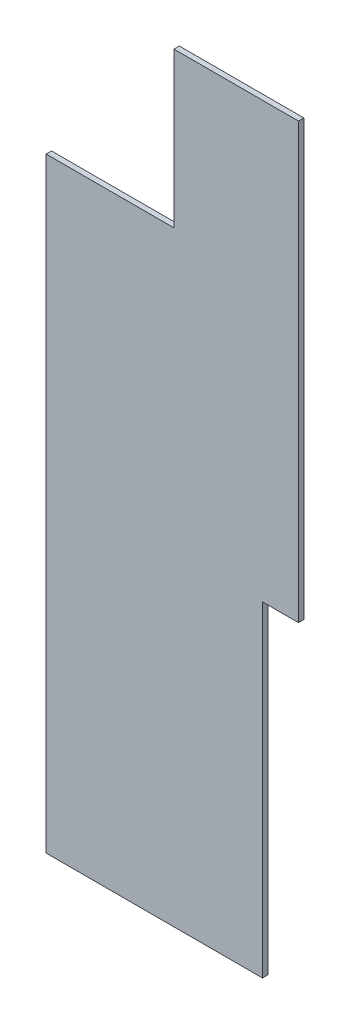
ISO-10303-21;
HEADER;
FILE_DESCRIPTION(('STEP AP214'),'2;1');
FILE_NAME('part.step','',(''),(''),'','','');
FILE_SCHEMA(('AUTOMOTIVE_DESIGN { 1 0 10303 214 1 1 1 1 }'));
ENDSEC;
DATA;
#1=APPLICATION_CONTEXT('core data for automotive mechanical design processes');
#2=APPLICATION_PROTOCOL_DEFINITION('international standard','automotive_design',2000,#1);
#3=PRODUCT_CONTEXT('',#1,'mechanical');
#4=PRODUCT('Part','Part','',(#3));
#5=PRODUCT_RELATED_PRODUCT_CATEGORY('part','',(#4));
#6=PRODUCT_DEFINITION_FORMATION('','',#4);
#7=PRODUCT_DEFINITION_CONTEXT('part definition',#1,'design');
#8=PRODUCT_DEFINITION('design','',#6,#7);
#9=PRODUCT_DEFINITION_SHAPE('','',#8);
#10=(LENGTH_UNIT() NAMED_UNIT(*) SI_UNIT(.MILLI.,.METRE.));
#11=(NAMED_UNIT(*) PLANE_ANGLE_UNIT() SI_UNIT($,.RADIAN.));
#12=(NAMED_UNIT(*) SI_UNIT($,.STERADIAN.) SOLID_ANGLE_UNIT());
#13=UNCERTAINTY_MEASURE_WITH_UNIT(LENGTH_MEASURE(1.E-05),#10,'distance_accuracy_value','');
#14=(GEOMETRIC_REPRESENTATION_CONTEXT(3) GLOBAL_UNCERTAINTY_ASSIGNED_CONTEXT((#13)) GLOBAL_UNIT_ASSIGNED_CONTEXT((#10,
#11,#12)) REPRESENTATION_CONTEXT('',''));
#15=CARTESIAN_POINT('',(0.,0.,0.));
#16=DIRECTION('',(0.,0.,1.));
#17=DIRECTION('',(1.,0.,0.));
#18=AXIS2_PLACEMENT_3D('',#15,#16,#17);
#19=CARTESIAN_POINT('',(1520.,0.,-15.));
#20=DIRECTION('',(0.,-1.,0.));
#21=DIRECTION('',(1.,0.,0.));
#22=AXIS2_PLACEMENT_3D('',#19,#20,#21);
#23=PLANE('',#22);
#24=DIRECTION('',(1.,0.,0.));
#25=VECTOR('',#24,1.);
#26=CARTESIAN_POINT('',(1520.,0.,-15.));
#27=LINE('',#26,#25);
#28=CARTESIAN_POINT('',(0.,0.,-15.));
#29=VERTEX_POINT('',#28);
#30=CARTESIAN_POINT('',(601.,0.,-15.));
#31=VERTEX_POINT('',#30);
#32=EDGE_CURVE('E120',#29,#31,#27,.T.);
#33=ORIENTED_EDGE('',*,*,#32,.T.);
#34=DIRECTION('',(0.,0.,1.));
#35=VECTOR('',#34,1.);
#36=CARTESIAN_POINT('',(601.,0.,-15.));
#37=LINE('',#36,#35);
#38=CARTESIAN_POINT('',(601.,0.,0.));
#39=VERTEX_POINT('',#38);
#40=EDGE_CURVE('E102',#31,#39,#37,.T.);
#41=ORIENTED_EDGE('',*,*,#40,.T.);
#42=DIRECTION('',(1.,0.,0.));
#43=VECTOR('',#42,1.);
#44=CARTESIAN_POINT('',(1520.,0.,0.));
#45=LINE('',#44,#43);
#46=CARTESIAN_POINT('',(0.,0.,0.));
#47=VERTEX_POINT('',#46);
#48=EDGE_CURVE('E127',#47,#39,#45,.T.);
#49=ORIENTED_EDGE('',*,*,#48,.F.);
#50=DIRECTION('',(0.,0.,1.));
#51=VECTOR('',#50,1.);
#52=CARTESIAN_POINT('',(0.,0.,-15.));
#53=LINE('',#52,#51);
#54=EDGE_CURVE('E123',#29,#47,#53,.T.);
#55=ORIENTED_EDGE('',*,*,#54,.F.);
#56=EDGE_LOOP('',(#33,#41,#49,#55));
#57=FACE_BOUND('',#56,.T.);
#58=ADVANCED_FACE('F38',(#57),#23,.T.);
#59=CARTESIAN_POINT('',(0.,0.,-15.));
#60=DIRECTION('',(0.,0.,-1.));
#61=DIRECTION('',(-1.,0.,0.));
#62=AXIS2_PLACEMENT_3D('',#59,#60,#61);
#63=PLANE('',#62);
#64=DIRECTION('',(-1.,0.,0.));
#65=VECTOR('',#64,1.);
#66=CARTESIAN_POINT('',(-1.24043436701946E-13,905.,-15.));
#67=LINE('',#66,#65);
#68=CARTESIAN_POINT('',(701.,905.,-15.));
#69=VERTEX_POINT('',#68);
#70=CARTESIAN_POINT('',(601.,905.,-15.));
#71=VERTEX_POINT('',#70);
#72=EDGE_CURVE('E114',#69,#71,#67,.T.);
#73=ORIENTED_EDGE('',*,*,#72,.T.);
#74=DIRECTION('',(0.,1.,0.));
#75=VECTOR('',#74,1.);
#76=CARTESIAN_POINT('',(601.,0.,-15.));
#77=LINE('',#76,#75);
#78=EDGE_CURVE('E106',#31,#71,#77,.T.);
#79=ORIENTED_EDGE('',*,*,#78,.F.);
#80=ORIENTED_EDGE('',*,*,#32,.F.);
#81=DIRECTION('',(0.,-1.,0.));
#82=VECTOR('',#81,1.);
#83=CARTESIAN_POINT('',(0.,0.,-15.));
#84=LINE('',#83,#82);
#85=CARTESIAN_POINT('',(0.,1682.,-15.));
#86=VERTEX_POINT('',#85);
#87=EDGE_CURVE('E61',#86,#29,#84,.T.);
#88=ORIENTED_EDGE('',*,*,#87,.F.);
#89=DIRECTION('',(1.,0.,0.));
#90=VECTOR('',#89,1.);
#91=CARTESIAN_POINT('',(0.,1682.,-15.));
#92=LINE('',#91,#90);
#93=CARTESIAN_POINT('',(355.,1682.,-15.));
#94=VERTEX_POINT('',#93);
#95=EDGE_CURVE('E158',#86,#94,#92,.T.);
#96=ORIENTED_EDGE('',*,*,#95,.T.);
#97=DIRECTION('',(0.,-1.,0.));
#98=VECTOR('',#97,1.);
#99=CARTESIAN_POINT('',(354.999999999998,-4.12460763218297E-13,-15.));
#100=LINE('',#99,#98);
#101=CARTESIAN_POINT('',(355.,2112.,-15.));
#102=VERTEX_POINT('',#101);
#103=EDGE_CURVE('E161',#102,#94,#100,.T.);
#104=ORIENTED_EDGE('',*,*,#103,.F.);
#105=DIRECTION('',(1.,0.,0.));
#106=VECTOR('',#105,1.);
#107=CARTESIAN_POINT('',(0.,2112.,-15.));
#108=LINE('',#107,#106);
#109=CARTESIAN_POINT('',(701.,2112.,-15.));
#110=VERTEX_POINT('',#109);
#111=EDGE_CURVE('E163',#102,#110,#108,.T.);
#112=ORIENTED_EDGE('',*,*,#111,.T.);
#113=DIRECTION('',(0.,-1.,0.));
#114=VECTOR('',#113,1.);
#115=CARTESIAN_POINT('',(701.,2112.,-15.));
#116=LINE('',#115,#114);
#117=EDGE_CURVE('E52',#110,#69,#116,.T.);
#118=ORIENTED_EDGE('',*,*,#117,.T.);
#119=EDGE_LOOP('',(#73,#79,#80,#88,#96,#104,#112,#118));
#120=FACE_BOUND('',#119,.T.);
#121=ADVANCED_FACE('F119',(#120),#63,.T.);
#122=CARTESIAN_POINT('',(0.,0.,0.));
#123=DIRECTION('',(0.,0.,-1.));
#124=DIRECTION('',(-1.,0.,0.));
#125=AXIS2_PLACEMENT_3D('',#122,#123,#124);
#126=PLANE('',#125);
#127=DIRECTION('',(0.,-1.,0.));
#128=VECTOR('',#127,1.);
#129=CARTESIAN_POINT('',(601.,0.,0.));
#130=LINE('',#129,#128);
#131=CARTESIAN_POINT('',(601.,905.,0.));
#132=VERTEX_POINT('',#131);
#133=EDGE_CURVE('E11',#132,#39,#130,.T.);
#134=ORIENTED_EDGE('',*,*,#133,.F.);
#135=DIRECTION('',(1.,0.,0.));
#136=VECTOR('',#135,1.);
#137=CARTESIAN_POINT('',(-1.24043436701946E-13,905.,0.));
#138=LINE('',#137,#136);
#139=CARTESIAN_POINT('',(701.,905.,0.));
#140=VERTEX_POINT('',#139);
#141=EDGE_CURVE('E45',#132,#140,#138,.T.);
#142=ORIENTED_EDGE('',*,*,#141,.T.);
#143=DIRECTION('',(0.,1.,0.));
#144=VECTOR('',#143,1.);
#145=CARTESIAN_POINT('',(701.,0.,0.));
#146=LINE('',#145,#144);
#147=CARTESIAN_POINT('',(701.,2112.,0.));
#148=VERTEX_POINT('',#147);
#149=EDGE_CURVE('E144',#140,#148,#146,.T.);
#150=ORIENTED_EDGE('',*,*,#149,.T.);
#151=DIRECTION('',(-1.,0.,0.));
#152=VECTOR('',#151,1.);
#153=CARTESIAN_POINT('',(0.,2112.,0.));
#154=LINE('',#153,#152);
#155=CARTESIAN_POINT('',(355.,2112.,0.));
#156=VERTEX_POINT('',#155);
#157=EDGE_CURVE('E130',#148,#156,#154,.T.);
#158=ORIENTED_EDGE('',*,*,#157,.T.);
#159=DIRECTION('',(0.,1.,0.));
#160=VECTOR('',#159,1.);
#161=CARTESIAN_POINT('',(354.999999999998,-4.12460763218297E-13,0.));
#162=LINE('',#161,#160);
#163=CARTESIAN_POINT('',(355.,1682.,0.));
#164=VERTEX_POINT('',#163);
#165=EDGE_CURVE('E138',#164,#156,#162,.T.);
#166=ORIENTED_EDGE('',*,*,#165,.F.);
#167=DIRECTION('',(-1.,0.,0.));
#168=VECTOR('',#167,1.);
#169=CARTESIAN_POINT('',(0.,1682.,0.));
#170=LINE('',#169,#168);
#171=CARTESIAN_POINT('',(0.,1682.,0.));
#172=VERTEX_POINT('',#171);
#173=EDGE_CURVE('E135',#164,#172,#170,.T.);
#174=ORIENTED_EDGE('',*,*,#173,.T.);
#175=DIRECTION('',(0.,-1.,0.));
#176=VECTOR('',#175,1.);
#177=CARTESIAN_POINT('',(0.,0.,0.));
#178=LINE('',#177,#176);
#179=EDGE_CURVE('E124',#172,#47,#178,.T.);
#180=ORIENTED_EDGE('',*,*,#179,.T.);
#181=ORIENTED_EDGE('',*,*,#48,.T.);
#182=EDGE_LOOP('',(#134,#142,#150,#158,#166,#174,#180,#181));
#183=FACE_BOUND('',#182,.T.);
#184=ADVANCED_FACE('F143',(#183),#126,.F.);
#185=CARTESIAN_POINT('',(0.,0.,-15.));
#186=DIRECTION('',(-1.,0.,0.));
#187=DIRECTION('',(0.,0.,1.));
#188=AXIS2_PLACEMENT_3D('',#185,#186,#187);
#189=PLANE('',#188);
#190=DIRECTION('',(0.,0.,1.));
#191=VECTOR('',#190,1.);
#192=CARTESIAN_POINT('',(0.,1682.,-15.));
#193=LINE('',#192,#191);
#194=EDGE_CURVE('E166',#86,#172,#193,.T.);
#195=ORIENTED_EDGE('',*,*,#194,.F.);
#196=ORIENTED_EDGE('',*,*,#87,.T.);
#197=ORIENTED_EDGE('',*,*,#54,.T.);
#198=ORIENTED_EDGE('',*,*,#179,.F.);
#199=EDGE_LOOP('',(#195,#196,#197,#198));
#200=FACE_BOUND('',#199,.T.);
#201=ADVANCED_FACE('F177',(#200),#189,.T.);
#202=CARTESIAN_POINT('',(354.999999999998,-4.12460763218297E-13,-15.));
#203=DIRECTION('',(-1.,0.,0.));
#204=DIRECTION('',(0.,-1.,0.));
#205=AXIS2_PLACEMENT_3D('',#202,#203,#204);
#206=PLANE('',#205);
#207=ORIENTED_EDGE('',*,*,#165,.T.);
#208=DIRECTION('',(0.,0.,1.));
#209=VECTOR('',#208,1.);
#210=CARTESIAN_POINT('',(355.,2112.,-15.));
#211=LINE('',#210,#209);
#212=EDGE_CURVE('E167',#102,#156,#211,.T.);
#213=ORIENTED_EDGE('',*,*,#212,.F.);
#214=ORIENTED_EDGE('',*,*,#103,.T.);
#215=DIRECTION('',(0.,0.,1.));
#216=VECTOR('',#215,1.);
#217=CARTESIAN_POINT('',(355.,1682.,-15.));
#218=LINE('',#217,#216);
#219=EDGE_CURVE('E170',#94,#164,#218,.T.);
#220=ORIENTED_EDGE('',*,*,#219,.T.);
#221=EDGE_LOOP('',(#207,#213,#214,#220));
#222=FACE_BOUND('',#221,.T.);
#223=ADVANCED_FACE('F179',(#222),#206,.T.);
#224=CARTESIAN_POINT('',(0.,1682.,-15.));
#225=DIRECTION('',(0.,-1.,0.));
#226=DIRECTION('',(0.,0.,-1.));
#227=AXIS2_PLACEMENT_3D('',#224,#225,#226);
#228=PLANE('',#227);
#229=ORIENTED_EDGE('',*,*,#219,.F.);
#230=ORIENTED_EDGE('',*,*,#95,.F.);
#231=ORIENTED_EDGE('',*,*,#194,.T.);
#232=ORIENTED_EDGE('',*,*,#173,.F.);
#233=EDGE_LOOP('',(#229,#230,#231,#232));
#234=FACE_BOUND('',#233,.T.);
#235=ADVANCED_FACE('F174',(#234),#228,.F.);
#236=CARTESIAN_POINT('',(0.,2112.,-15.));
#237=DIRECTION('',(0.,-1.,0.));
#238=DIRECTION('',(0.,0.,-1.));
#239=AXIS2_PLACEMENT_3D('',#236,#237,#238);
#240=PLANE('',#239);
#241=ORIENTED_EDGE('',*,*,#157,.F.);
#242=DIRECTION('',(0.,0.,1.));
#243=VECTOR('',#242,1.);
#244=CARTESIAN_POINT('',(701.,2112.,-15.));
#245=LINE('',#244,#243);
#246=EDGE_CURVE('E151',#110,#148,#245,.T.);
#247=ORIENTED_EDGE('',*,*,#246,.F.);
#248=ORIENTED_EDGE('',*,*,#111,.F.);
#249=ORIENTED_EDGE('',*,*,#212,.T.);
#250=EDGE_LOOP('',(#241,#247,#248,#249));
#251=FACE_BOUND('',#250,.T.);
#252=ADVANCED_FACE('F196',(#251),#240,.F.);
#253=CARTESIAN_POINT('',(701.,2112.,-15.));
#254=DIRECTION('',(-1.,0.,0.));
#255=DIRECTION('',(0.,-1.,0.));
#256=AXIS2_PLACEMENT_3D('',#253,#254,#255);
#257=PLANE('',#256);
#258=ORIENTED_EDGE('',*,*,#149,.F.);
#259=DIRECTION('',(0.,0.,1.));
#260=VECTOR('',#259,1.);
#261=CARTESIAN_POINT('',(701.,905.,-15.));
#262=LINE('',#261,#260);
#263=EDGE_CURVE('E113',#69,#140,#262,.T.);
#264=ORIENTED_EDGE('',*,*,#263,.F.);
#265=ORIENTED_EDGE('',*,*,#117,.F.);
#266=ORIENTED_EDGE('',*,*,#246,.T.);
#267=EDGE_LOOP('',(#258,#264,#265,#266));
#268=FACE_BOUND('',#267,.T.);
#269=ADVANCED_FACE('F200',(#268),#257,.F.);
#270=CARTESIAN_POINT('',(601.,0.,-15.));
#271=DIRECTION('',(1.,0.,0.));
#272=DIRECTION('',(0.,0.,-1.));
#273=AXIS2_PLACEMENT_3D('',#270,#271,#272);
#274=PLANE('',#273);
#275=ORIENTED_EDGE('',*,*,#133,.T.);
#276=ORIENTED_EDGE('',*,*,#40,.F.);
#277=ORIENTED_EDGE('',*,*,#78,.T.);
#278=DIRECTION('',(0.,0.,1.));
#279=VECTOR('',#278,1.);
#280=CARTESIAN_POINT('',(601.,905.,-15.));
#281=LINE('',#280,#279);
#282=EDGE_CURVE('E149',#71,#132,#281,.T.);
#283=ORIENTED_EDGE('',*,*,#282,.T.);
#284=EDGE_LOOP('',(#275,#276,#277,#283));
#285=FACE_BOUND('',#284,.T.);
#286=ADVANCED_FACE('F104',(#285),#274,.T.);
#287=CARTESIAN_POINT('',(-1.24043436701946E-13,905.,-15.));
#288=DIRECTION('',(0.,1.,0.));
#289=DIRECTION('',(-1.,0.,0.));
#290=AXIS2_PLACEMENT_3D('',#287,#288,#289);
#291=PLANE('',#290);
#292=ORIENTED_EDGE('',*,*,#282,.F.);
#293=ORIENTED_EDGE('',*,*,#72,.F.);
#294=ORIENTED_EDGE('',*,*,#263,.T.);
#295=ORIENTED_EDGE('',*,*,#141,.F.);
#296=EDGE_LOOP('',(#292,#293,#294,#295));
#297=FACE_BOUND('',#296,.T.);
#298=ADVANCED_FACE('F148',(#297),#291,.F.);
#299=CLOSED_SHELL('',(#58,#121,#184,#201,#223,#235,#252,#269,#286,#298));
#300=MANIFOLD_SOLID_BREP('B2',#299);
#301=ADVANCED_BREP_SHAPE_REPRESENTATION('',(#18,#300),#14);
#302=SHAPE_DEFINITION_REPRESENTATION(#9,#301);
ENDSEC;
END-ISO-10303-21;
